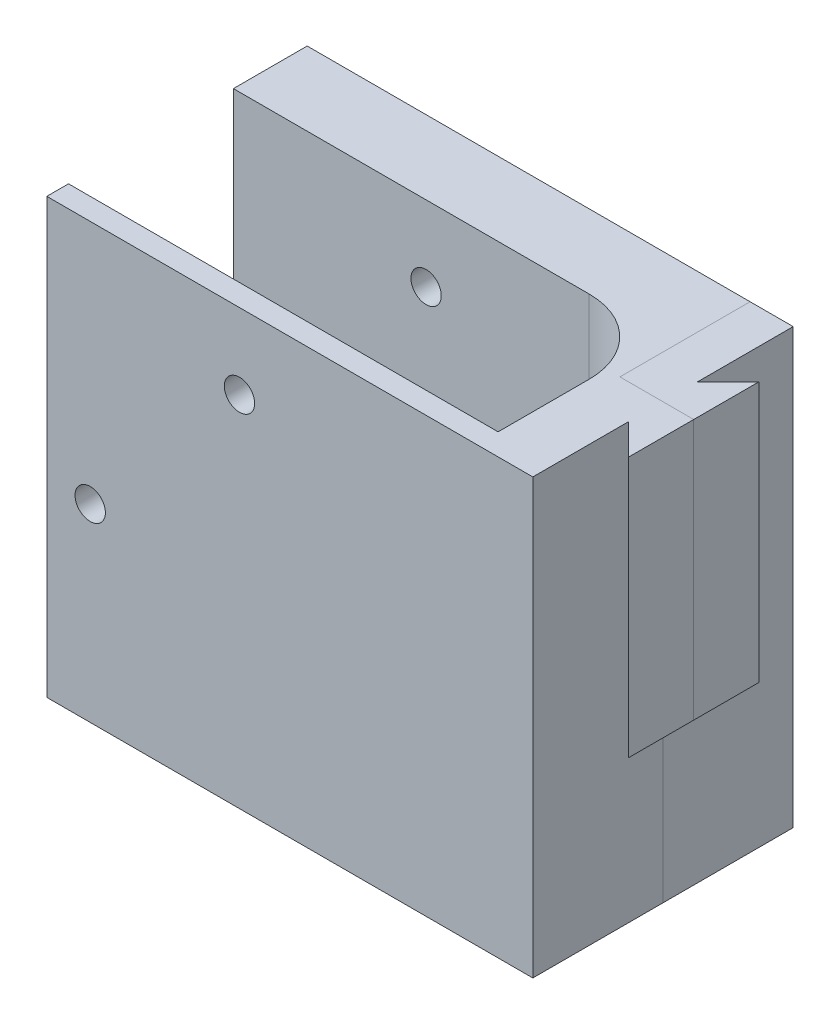
ISO-10303-21;
HEADER;
FILE_DESCRIPTION(('STEP AP214'),'2;1');
FILE_NAME('part.step','',(''),(''),'','','');
FILE_SCHEMA(('AUTOMOTIVE_DESIGN { 1 0 10303 214 1 1 1 1 }'));
ENDSEC;
DATA;
#1=APPLICATION_CONTEXT('core data for automotive mechanical design processes');
#2=APPLICATION_PROTOCOL_DEFINITION('international standard','automotive_design',2000,#1);
#3=PRODUCT_CONTEXT('',#1,'mechanical');
#4=PRODUCT('Part','Part','',(#3));
#5=PRODUCT_RELATED_PRODUCT_CATEGORY('part','',(#4));
#6=PRODUCT_DEFINITION_FORMATION('','',#4);
#7=PRODUCT_DEFINITION_CONTEXT('part definition',#1,'design');
#8=PRODUCT_DEFINITION('design','',#6,#7);
#9=PRODUCT_DEFINITION_SHAPE('','',#8);
#10=(LENGTH_UNIT() NAMED_UNIT(*) SI_UNIT(.MILLI.,.METRE.));
#11=(NAMED_UNIT(*) PLANE_ANGLE_UNIT() SI_UNIT($,.RADIAN.));
#12=(NAMED_UNIT(*) SI_UNIT($,.STERADIAN.) SOLID_ANGLE_UNIT());
#13=UNCERTAINTY_MEASURE_WITH_UNIT(LENGTH_MEASURE(1.E-05),#10,'distance_accuracy_value','');
#14=(GEOMETRIC_REPRESENTATION_CONTEXT(3) GLOBAL_UNCERTAINTY_ASSIGNED_CONTEXT((#13)) GLOBAL_UNIT_ASSIGNED_CONTEXT((#10,
#11,#12)) REPRESENTATION_CONTEXT('',''));
#15=CARTESIAN_POINT('',(0.,0.,0.));
#16=DIRECTION('',(0.,0.,1.));
#17=DIRECTION('',(1.,0.,0.));
#18=AXIS2_PLACEMENT_3D('',#15,#16,#17);
#19=CARTESIAN_POINT('',(71.0355339059328,-0.0100000000000031,15.));
#20=DIRECTION('',(0.,0.,1.));
#21=DIRECTION('',(1.,0.,0.));
#22=AXIS2_PLACEMENT_3D('',#19,#20,#21);
#23=PLANE('',#22);
#24=DIRECTION('',(0.,1.,0.));
#25=VECTOR('',#24,1.);
#26=CARTESIAN_POINT('',(51.0355339059328,-0.0100000000000031,15.));
#27=LINE('',#26,#25);
#28=CARTESIAN_POINT('',(51.0355339059328,0.,15.));
#29=VERTEX_POINT('',#28);
#30=CARTESIAN_POINT('',(51.0355339059328,50.,15.));
#31=VERTEX_POINT('',#30);
#32=EDGE_CURVE('E12',#29,#31,#27,.T.);
#33=ORIENTED_EDGE('',*,*,#32,.F.);
#34=DIRECTION('',(1.,0.,0.));
#35=VECTOR('',#34,1.);
#36=CARTESIAN_POINT('',(0.,0.,15.));
#37=LINE('',#36,#35);
#38=CARTESIAN_POINT('',(56.,0.,15.));
#39=VERTEX_POINT('',#38);
#40=EDGE_CURVE('E130',#29,#39,#37,.T.);
#41=ORIENTED_EDGE('',*,*,#40,.T.);
#42=DIRECTION('',(0.,1.,0.));
#43=VECTOR('',#42,1.);
#44=CARTESIAN_POINT('',(56.,0.,15.));
#45=LINE('',#44,#43);
#46=CARTESIAN_POINT('',(56.,20.,15.));
#47=VERTEX_POINT('',#46);
#48=EDGE_CURVE('E137',#39,#47,#45,.T.);
#49=ORIENTED_EDGE('',*,*,#48,.T.);
#50=DIRECTION('',(-1.,0.,0.));
#51=VECTOR('',#50,1.);
#52=CARTESIAN_POINT('',(0.,20.,15.));
#53=LINE('',#52,#51);
#54=CARTESIAN_POINT('',(59.5355339059328,20.,15.));
#55=VERTEX_POINT('',#54);
#56=EDGE_CURVE('E165',#55,#47,#53,.T.);
#57=ORIENTED_EDGE('',*,*,#56,.F.);
#58=DIRECTION('',(0.,-1.,0.));
#59=VECTOR('',#58,1.);
#60=CARTESIAN_POINT('',(59.5355339059328,20.,15.));
#61=LINE('',#60,#59);
#62=CARTESIAN_POINT('',(59.5355339059328,50.,15.));
#63=VERTEX_POINT('',#62);
#64=EDGE_CURVE('E146',#63,#55,#61,.T.);
#65=ORIENTED_EDGE('',*,*,#64,.F.);
#66=DIRECTION('',(1.,0.,0.));
#67=VECTOR('',#66,1.);
#68=CARTESIAN_POINT('',(0.,50.,15.));
#69=LINE('',#68,#67);
#70=EDGE_CURVE('E167',#31,#63,#69,.T.);
#71=ORIENTED_EDGE('',*,*,#70,.F.);
#72=EDGE_LOOP('',(#33,#41,#49,#57,#65,#71));
#73=FACE_BOUND('',#72,.T.);
#74=ADVANCED_FACE('F49',(#73),#23,.T.);
#75=CARTESIAN_POINT('',(51.0355339059328,-0.0100000000000031,15.));
#76=DIRECTION('',(-1.,0.,0.));
#77=DIRECTION('',(0.,0.,1.));
#78=AXIS2_PLACEMENT_3D('',#75,#76,#77);
#79=PLANE('',#78);
#80=DIRECTION('',(0.,-1.,0.));
#81=VECTOR('',#80,1.);
#82=CARTESIAN_POINT('',(51.0355339059328,0.,0.));
#83=LINE('',#82,#81);
#84=CARTESIAN_POINT('',(51.0355339059328,50.,0.));
#85=VERTEX_POINT('',#84);
#86=CARTESIAN_POINT('',(51.0355339059328,0.,0.));
#87=VERTEX_POINT('',#86);
#88=EDGE_CURVE('E120',#85,#87,#83,.T.);
#89=ORIENTED_EDGE('',*,*,#88,.T.);
#90=DIRECTION('',(0.,0.,1.));
#91=VECTOR('',#90,1.);
#92=CARTESIAN_POINT('',(51.0355339059328,0.,30.));
#93=LINE('',#92,#91);
#94=EDGE_CURVE('E127',#87,#29,#93,.T.);
#95=ORIENTED_EDGE('',*,*,#94,.T.);
#96=ORIENTED_EDGE('',*,*,#32,.T.);
#97=DIRECTION('',(0.,0.,1.));
#98=VECTOR('',#97,1.);
#99=CARTESIAN_POINT('',(51.0355339059328,50.,30.));
#100=LINE('',#99,#98);
#101=EDGE_CURVE('E132',#85,#31,#100,.T.);
#102=ORIENTED_EDGE('',*,*,#101,.F.);
#103=EDGE_LOOP('',(#89,#95,#96,#102));
#104=FACE_BOUND('',#103,.T.);
#105=ADVANCED_FACE('F135',(#104),#79,.T.);
#106=CARTESIAN_POINT('',(0.,0.,30.));
#107=DIRECTION('',(0.,1.,0.));
#108=DIRECTION('',(0.,0.,1.));
#109=AXIS2_PLACEMENT_3D('',#106,#107,#108);
#110=PLANE('',#109);
#111=ORIENTED_EDGE('',*,*,#94,.F.);
#112=DIRECTION('',(1.,0.,0.));
#113=VECTOR('',#112,1.);
#114=CARTESIAN_POINT('',(0.,0.,0.));
#115=LINE('',#114,#113);
#116=CARTESIAN_POINT('',(56.,0.,0.));
#117=VERTEX_POINT('',#116);
#118=EDGE_CURVE('E116',#87,#117,#115,.T.);
#119=ORIENTED_EDGE('',*,*,#118,.T.);
#120=DIRECTION('',(0.,0.,-1.));
#121=VECTOR('',#120,1.);
#122=CARTESIAN_POINT('',(56.,0.,30.));
#123=LINE('',#122,#121);
#124=EDGE_CURVE('E85',#39,#117,#123,.T.);
#125=ORIENTED_EDGE('',*,*,#124,.F.);
#126=ORIENTED_EDGE('',*,*,#40,.F.);
#127=EDGE_LOOP('',(#111,#119,#125,#126));
#128=FACE_BOUND('',#127,.T.);
#129=ADVANCED_FACE('F128',(#128),#110,.F.);
#130=CARTESIAN_POINT('',(56.,0.,30.));
#131=DIRECTION('',(-1.,0.,0.));
#132=DIRECTION('',(0.,-1.,0.));
#133=AXIS2_PLACEMENT_3D('',#130,#131,#132);
#134=PLANE('',#133);
#135=ORIENTED_EDGE('',*,*,#48,.F.);
#136=ORIENTED_EDGE('',*,*,#124,.T.);
#137=DIRECTION('',(0.,1.,0.));
#138=VECTOR('',#137,1.);
#139=CARTESIAN_POINT('',(56.,0.,0.));
#140=LINE('',#139,#138);
#141=CARTESIAN_POINT('',(56.,50.,0.));
#142=VERTEX_POINT('',#141);
#143=EDGE_CURVE('E121',#117,#142,#140,.T.);
#144=ORIENTED_EDGE('',*,*,#143,.T.);
#145=DIRECTION('',(0.,0.,-1.));
#146=VECTOR('',#145,1.);
#147=CARTESIAN_POINT('',(56.,50.,30.));
#148=LINE('',#147,#146);
#149=CARTESIAN_POINT('',(56.,50.,11.0355339059327));
#150=VERTEX_POINT('',#149);
#151=EDGE_CURVE('E148',#150,#142,#148,.T.);
#152=ORIENTED_EDGE('',*,*,#151,.F.);
#153=DIRECTION('',(0.,1.,0.));
#154=VECTOR('',#153,1.);
#155=CARTESIAN_POINT('',(56.0000000000001,20.,11.0355339059327));
#156=LINE('',#155,#154);
#157=CARTESIAN_POINT('',(56.0000000000001,20.,11.0355339059327));
#158=VERTEX_POINT('',#157);
#159=EDGE_CURVE('E151',#158,#150,#156,.T.);
#160=ORIENTED_EDGE('',*,*,#159,.F.);
#161=DIRECTION('',(0.,0.,1.));
#162=VECTOR('',#161,1.);
#163=CARTESIAN_POINT('',(56.,20.,30.));
#164=LINE('',#163,#162);
#165=EDGE_CURVE('E143',#158,#47,#164,.T.);
#166=ORIENTED_EDGE('',*,*,#165,.T.);
#167=EDGE_LOOP('',(#135,#136,#144,#152,#160,#166));
#168=FACE_BOUND('',#167,.T.);
#169=ADVANCED_FACE('F172',(#168),#134,.F.);
#170=CARTESIAN_POINT('',(59.5355339059328,20.,7.5));
#171=DIRECTION('',(-0.707106781186547,0.,-0.707106781186548));
#172=DIRECTION('',(-0.707106781186548,0.,0.707106781186547));
#173=AXIS2_PLACEMENT_3D('',#170,#171,#172);
#174=PLANE('',#173);
#175=DIRECTION('',(-0.707106781186548,0.,0.707106781186547));
#176=VECTOR('',#175,1.);
#177=CARTESIAN_POINT('',(59.5355339059328,50.,7.5));
#178=LINE('',#177,#176);
#179=CARTESIAN_POINT('',(59.5355339059328,50.,7.5));
#180=VERTEX_POINT('',#179);
#181=EDGE_CURVE('E59',#180,#150,#178,.T.);
#182=ORIENTED_EDGE('',*,*,#181,.F.);
#183=DIRECTION('',(0.,1.,0.));
#184=VECTOR('',#183,1.);
#185=CARTESIAN_POINT('',(59.5355339059328,20.,7.5));
#186=LINE('',#185,#184);
#187=CARTESIAN_POINT('',(59.5355339059328,20.,7.5));
#188=VERTEX_POINT('',#187);
#189=EDGE_CURVE('E123',#188,#180,#186,.T.);
#190=ORIENTED_EDGE('',*,*,#189,.F.);
#191=DIRECTION('',(-0.707106781186548,0.,0.707106781186547));
#192=VECTOR('',#191,1.);
#193=CARTESIAN_POINT('',(59.5355339059328,20.,7.5));
#194=LINE('',#193,#192);
#195=EDGE_CURVE('E150',#188,#158,#194,.T.);
#196=ORIENTED_EDGE('',*,*,#195,.T.);
#197=ORIENTED_EDGE('',*,*,#159,.T.);
#198=EDGE_LOOP('',(#182,#190,#196,#197));
#199=FACE_BOUND('',#198,.T.);
#200=ADVANCED_FACE('F176',(#199),#174,.T.);
#201=CARTESIAN_POINT('',(0.,20.,0.));
#202=DIRECTION('',(0.,-1.,0.));
#203=DIRECTION('',(0.,0.,-1.));
#204=AXIS2_PLACEMENT_3D('',#201,#202,#203);
#205=PLANE('',#204);
#206=DIRECTION('',(0.,0.,-1.));
#207=VECTOR('',#206,1.);
#208=CARTESIAN_POINT('',(59.5355339059328,20.,7.5));
#209=LINE('',#208,#207);
#210=EDGE_CURVE('E77',#55,#188,#209,.T.);
#211=ORIENTED_EDGE('',*,*,#210,.F.);
#212=ORIENTED_EDGE('',*,*,#56,.T.);
#213=ORIENTED_EDGE('',*,*,#165,.F.);
#214=ORIENTED_EDGE('',*,*,#195,.F.);
#215=EDGE_LOOP('',(#211,#212,#213,#214));
#216=FACE_BOUND('',#215,.T.);
#217=ADVANCED_FACE('F175',(#216),#205,.T.);
#218=CARTESIAN_POINT('',(0.,50.,30.));
#219=DIRECTION('',(0.,1.,0.));
#220=DIRECTION('',(0.,0.,1.));
#221=AXIS2_PLACEMENT_3D('',#218,#219,#220);
#222=PLANE('',#221);
#223=DIRECTION('',(1.,0.,0.));
#224=VECTOR('',#223,1.);
#225=CARTESIAN_POINT('',(0.,50.,0.));
#226=LINE('',#225,#224);
#227=EDGE_CURVE('E93',#85,#142,#226,.T.);
#228=ORIENTED_EDGE('',*,*,#227,.F.);
#229=ORIENTED_EDGE('',*,*,#101,.T.);
#230=ORIENTED_EDGE('',*,*,#70,.T.);
#231=DIRECTION('',(0.,0.,-1.));
#232=VECTOR('',#231,1.);
#233=CARTESIAN_POINT('',(59.5355339059328,50.,7.5));
#234=LINE('',#233,#232);
#235=EDGE_CURVE('E53',#63,#180,#234,.T.);
#236=ORIENTED_EDGE('',*,*,#235,.T.);
#237=ORIENTED_EDGE('',*,*,#181,.T.);
#238=ORIENTED_EDGE('',*,*,#151,.T.);
#239=EDGE_LOOP('',(#228,#229,#230,#236,#237,#238));
#240=FACE_BOUND('',#239,.T.);
#241=ADVANCED_FACE('F177',(#240),#222,.T.);
#242=CARTESIAN_POINT('',(59.5355339059328,20.,7.5));
#243=DIRECTION('',(1.,0.,0.));
#244=DIRECTION('',(0.,0.,-1.));
#245=AXIS2_PLACEMENT_3D('',#242,#243,#244);
#246=PLANE('',#245);
#247=ORIENTED_EDGE('',*,*,#235,.F.);
#248=ORIENTED_EDGE('',*,*,#64,.T.);
#249=ORIENTED_EDGE('',*,*,#210,.T.);
#250=ORIENTED_EDGE('',*,*,#189,.T.);
#251=EDGE_LOOP('',(#247,#248,#249,#250));
#252=FACE_BOUND('',#251,.T.);
#253=ADVANCED_FACE('F51',(#252),#246,.T.);
#254=CARTESIAN_POINT('',(0.,0.,0.));
#255=DIRECTION('',(0.,0.,1.));
#256=DIRECTION('',(1.,0.,0.));
#257=AXIS2_PLACEMENT_3D('',#254,#255,#256);
#258=PLANE('',#257);
#259=ORIENTED_EDGE('',*,*,#88,.F.);
#260=ORIENTED_EDGE('',*,*,#227,.T.);
#261=ORIENTED_EDGE('',*,*,#143,.F.);
#262=ORIENTED_EDGE('',*,*,#118,.F.);
#263=EDGE_LOOP('',(#259,#260,#261,#262));
#264=FACE_BOUND('',#263,.T.);
#265=ADVANCED_FACE('F118',(#264),#258,.F.);
#266=CLOSED_SHELL('',(#74,#105,#129,#169,#200,#217,#241,#253,#265));
#267=MANIFOLD_SOLID_BREP('B2',#266);
#268=CARTESIAN_POINT('',(71.0355339059328,-0.0100000000000031,15.));
#269=DIRECTION('',(0.,0.,1.));
#270=DIRECTION('',(1.,0.,0.));
#271=AXIS2_PLACEMENT_3D('',#268,#269,#270);
#272=PLANE('',#271);
#273=DIRECTION('',(0.,1.,0.));
#274=VECTOR('',#273,1.);
#275=CARTESIAN_POINT('',(51.0355339059328,-0.0100000000000031,15.));
#276=LINE('',#275,#274);
#277=CARTESIAN_POINT('',(51.0355339059328,0.,15.));
#278=VERTEX_POINT('',#277);
#279=CARTESIAN_POINT('',(51.0355339059328,50.,15.));
#280=VERTEX_POINT('',#279);
#281=EDGE_CURVE('E47',#278,#280,#276,.T.);
#282=ORIENTED_EDGE('',*,*,#281,.T.);
#283=DIRECTION('',(1.,0.,0.));
#284=VECTOR('',#283,1.);
#285=CARTESIAN_POINT('',(0.,50.,15.));
#286=LINE('',#285,#284);
#287=CARTESIAN_POINT('',(59.5355339059328,50.,15.));
#288=VERTEX_POINT('',#287);
#289=EDGE_CURVE('E523',#280,#288,#286,.T.);
#290=ORIENTED_EDGE('',*,*,#289,.T.);
#291=DIRECTION('',(0.,-1.,0.));
#292=VECTOR('',#291,1.);
#293=CARTESIAN_POINT('',(59.5355339059328,20.,15.));
#294=LINE('',#293,#292);
#295=CARTESIAN_POINT('',(59.5355339059328,20.,15.));
#296=VERTEX_POINT('',#295);
#297=EDGE_CURVE('E264',#288,#296,#294,.T.);
#298=ORIENTED_EDGE('',*,*,#297,.T.);
#299=DIRECTION('',(-1.,0.,0.));
#300=VECTOR('',#299,1.);
#301=CARTESIAN_POINT('',(0.,20.,15.));
#302=LINE('',#301,#300);
#303=CARTESIAN_POINT('',(56.,20.,15.));
#304=VERTEX_POINT('',#303);
#305=EDGE_CURVE('E279',#296,#304,#302,.T.);
#306=ORIENTED_EDGE('',*,*,#305,.T.);
#307=DIRECTION('',(0.,1.,0.));
#308=VECTOR('',#307,1.);
#309=CARTESIAN_POINT('',(56.,0.,15.));
#310=LINE('',#309,#308);
#311=CARTESIAN_POINT('',(56.,0.,15.));
#312=VERTEX_POINT('',#311);
#313=EDGE_CURVE('E367',#312,#304,#310,.T.);
#314=ORIENTED_EDGE('',*,*,#313,.F.);
#315=DIRECTION('',(1.,0.,0.));
#316=VECTOR('',#315,1.);
#317=CARTESIAN_POINT('',(0.,0.,15.));
#318=LINE('',#317,#316);
#319=EDGE_CURVE('E533',#278,#312,#318,.T.);
#320=ORIENTED_EDGE('',*,*,#319,.F.);
#321=EDGE_LOOP('',(#282,#290,#298,#306,#314,#320));
#322=FACE_BOUND('',#321,.T.);
#323=ADVANCED_FACE('F254',(#322),#272,.F.);
#324=CARTESIAN_POINT('',(51.0355339059328,-0.0100000000000031,15.));
#325=DIRECTION('',(-1.,0.,0.));
#326=DIRECTION('',(0.,0.,1.));
#327=AXIS2_PLACEMENT_3D('',#324,#325,#326);
#328=PLANE('',#327);
#329=DIRECTION('',(0.,-1.,0.));
#330=VECTOR('',#329,1.);
#331=CARTESIAN_POINT('',(51.0355339059328,0.,0.));
#332=LINE('',#331,#330);
#333=CARTESIAN_POINT('',(51.0355339059328,50.,0.));
#334=VERTEX_POINT('',#333);
#335=CARTESIAN_POINT('',(51.0355339059328,0.,0.));
#336=VERTEX_POINT('',#335);
#337=EDGE_CURVE('E370',#334,#336,#332,.T.);
#338=ORIENTED_EDGE('',*,*,#337,.F.);
#339=DIRECTION('',(0.,0.,1.));
#340=VECTOR('',#339,1.);
#341=CARTESIAN_POINT('',(51.0355339059328,50.,30.));
#342=LINE('',#341,#340);
#343=EDGE_CURVE('E526',#334,#280,#342,.T.);
#344=ORIENTED_EDGE('',*,*,#343,.T.);
#345=ORIENTED_EDGE('',*,*,#281,.F.);
#346=DIRECTION('',(0.,0.,1.));
#347=VECTOR('',#346,1.);
#348=CARTESIAN_POINT('',(51.0355339059328,0.,30.));
#349=LINE('',#348,#347);
#350=EDGE_CURVE('E258',#336,#278,#349,.T.);
#351=ORIENTED_EDGE('',*,*,#350,.F.);
#352=EDGE_LOOP('',(#338,#344,#345,#351));
#353=FACE_BOUND('',#352,.T.);
#354=ADVANCED_FACE('F256',(#353),#328,.F.);
#355=CARTESIAN_POINT('',(0.,0.,30.));
#356=DIRECTION('',(-1.,0.,0.));
#357=DIRECTION('',(0.,0.,1.));
#358=AXIS2_PLACEMENT_3D('',#355,#356,#357);
#359=PLANE('',#358);
#360=DIRECTION('',(0.,1.,0.));
#361=VECTOR('',#360,1.);
#362=CARTESIAN_POINT('',(0.,0.,27.5));
#363=LINE('',#362,#361);
#364=CARTESIAN_POINT('',(0.,0.,27.5));
#365=VERTEX_POINT('',#364);
#366=CARTESIAN_POINT('',(0.,50.,27.5));
#367=VERTEX_POINT('',#366);
#368=EDGE_CURVE('E429',#365,#367,#363,.T.);
#369=ORIENTED_EDGE('',*,*,#368,.F.);
#370=DIRECTION('',(0.,0.,-1.));
#371=VECTOR('',#370,1.);
#372=CARTESIAN_POINT('',(0.,0.,30.));
#373=LINE('',#372,#371);
#374=CARTESIAN_POINT('',(0.,0.,30.));
#375=VERTEX_POINT('',#374);
#376=EDGE_CURVE('E498',#375,#365,#373,.T.);
#377=ORIENTED_EDGE('',*,*,#376,.F.);
#378=DIRECTION('',(0.,1.,0.));
#379=VECTOR('',#378,1.);
#380=CARTESIAN_POINT('',(0.,0.,30.));
#381=LINE('',#380,#379);
#382=CARTESIAN_POINT('',(0.,50.,30.));
#383=VERTEX_POINT('',#382);
#384=EDGE_CURVE('E483',#375,#383,#381,.T.);
#385=ORIENTED_EDGE('',*,*,#384,.T.);
#386=DIRECTION('',(0.,0.,-1.));
#387=VECTOR('',#386,1.);
#388=CARTESIAN_POINT('',(0.,50.,30.));
#389=LINE('',#388,#387);
#390=EDGE_CURVE('E503',#383,#367,#389,.T.);
#391=ORIENTED_EDGE('',*,*,#390,.T.);
#392=EDGE_LOOP('',(#369,#377,#385,#391));
#393=FACE_BOUND('',#392,.T.);
#394=ADVANCED_FACE('F552',(#393),#359,.T.);
#395=CARTESIAN_POINT('',(22.2,41.3,30.));
#396=DIRECTION('',(0.,0.,-1.));
#397=DIRECTION('',(-1.,0.,0.));
#398=AXIS2_PLACEMENT_3D('',#395,#396,#397);
#399=CYLINDRICAL_SURFACE('',#398,1.75);
#400=CARTESIAN_POINT('',(22.2,41.3,27.5));
#401=DIRECTION('',(0.,0.,1.));
#402=DIRECTION('',(1.,0.,0.));
#403=AXIS2_PLACEMENT_3D('',#400,#401,#402);
#404=CIRCLE('',#403,1.75);
#405=CARTESIAN_POINT('',(23.95,41.3,27.5));
#406=VERTEX_POINT('',#405);
#407=EDGE_CURVE('E450',#406,#406,#404,.F.);
#408=ORIENTED_EDGE('',*,*,#407,.T.);
#409=EDGE_LOOP('',(#408));
#410=FACE_BOUND('',#409,.T.);
#411=CARTESIAN_POINT('',(22.2,41.3,30.));
#412=DIRECTION('',(0.,0.,-1.));
#413=DIRECTION('',(-1.,0.,0.));
#414=AXIS2_PLACEMENT_3D('',#411,#412,#413);
#415=CIRCLE('',#414,1.75);
#416=CARTESIAN_POINT('',(20.45,41.3,30.));
#417=VERTEX_POINT('',#416);
#418=EDGE_CURVE('E464',#417,#417,#415,.T.);
#419=ORIENTED_EDGE('',*,*,#418,.F.);
#420=EDGE_LOOP('',(#419));
#421=FACE_BOUND('',#420,.T.);
#422=ADVANCED_FACE('F593',(#410,#421),#399,.F.);
#423=CARTESIAN_POINT('',(5.,21.8,30.));
#424=DIRECTION('',(0.,0.,-1.));
#425=DIRECTION('',(-1.,0.,0.));
#426=AXIS2_PLACEMENT_3D('',#423,#424,#425);
#427=CYLINDRICAL_SURFACE('',#426,1.75);
#428=CARTESIAN_POINT('',(5.,21.8,27.5));
#429=DIRECTION('',(0.,0.,1.));
#430=DIRECTION('',(1.,0.,0.));
#431=AXIS2_PLACEMENT_3D('',#428,#429,#430);
#432=CIRCLE('',#431,1.75);
#433=CARTESIAN_POINT('',(6.75,21.8,27.5));
#434=VERTEX_POINT('',#433);
#435=EDGE_CURVE('E449',#434,#434,#432,.F.);
#436=ORIENTED_EDGE('',*,*,#435,.T.);
#437=EDGE_LOOP('',(#436));
#438=FACE_BOUND('',#437,.T.);
#439=CARTESIAN_POINT('',(5.,21.8,30.));
#440=DIRECTION('',(0.,0.,-1.));
#441=DIRECTION('',(-1.,0.,0.));
#442=AXIS2_PLACEMENT_3D('',#439,#440,#441);
#443=CIRCLE('',#442,1.75);
#444=CARTESIAN_POINT('',(3.25,21.8,30.));
#445=VERTEX_POINT('',#444);
#446=EDGE_CURVE('E455',#445,#445,#443,.T.);
#447=ORIENTED_EDGE('',*,*,#446,.F.);
#448=EDGE_LOOP('',(#447));
#449=FACE_BOUND('',#448,.T.);
#450=ADVANCED_FACE('F606',(#438,#449),#427,.F.);
#451=CARTESIAN_POINT('',(0.,0.,30.));
#452=DIRECTION('',(0.,1.,0.));
#453=DIRECTION('',(0.,0.,1.));
#454=AXIS2_PLACEMENT_3D('',#451,#452,#453);
#455=PLANE('',#454);
#456=DIRECTION('',(1.,0.,0.));
#457=VECTOR('',#456,1.);
#458=CARTESIAN_POINT('',(0.,0.,0.));
#459=LINE('',#458,#457);
#460=CARTESIAN_POINT('',(0.,0.,0.));
#461=VERTEX_POINT('',#460);
#462=EDGE_CURVE('E459',#461,#336,#459,.T.);
#463=ORIENTED_EDGE('',*,*,#462,.T.);
#464=ORIENTED_EDGE('',*,*,#350,.T.);
#465=ORIENTED_EDGE('',*,*,#319,.T.);
#466=DIRECTION('',(0.,0.,-1.));
#467=VECTOR('',#466,1.);
#468=CARTESIAN_POINT('',(56.,0.,30.));
#469=LINE('',#468,#467);
#470=CARTESIAN_POINT('',(56.,0.,30.));
#471=VERTEX_POINT('',#470);
#472=EDGE_CURVE('E371',#471,#312,#469,.T.);
#473=ORIENTED_EDGE('',*,*,#472,.F.);
#474=DIRECTION('',(1.,0.,0.));
#475=VECTOR('',#474,1.);
#476=CARTESIAN_POINT('',(0.,0.,30.));
#477=LINE('',#476,#475);
#478=EDGE_CURVE('E471',#375,#471,#477,.T.);
#479=ORIENTED_EDGE('',*,*,#478,.F.);
#480=ORIENTED_EDGE('',*,*,#376,.T.);
#481=DIRECTION('',(1.,0.,0.));
#482=VECTOR('',#481,1.);
#483=CARTESIAN_POINT('',(49.5,0.,27.5));
#484=LINE('',#483,#482);
#485=CARTESIAN_POINT('',(49.5,0.,27.5));
#486=VERTEX_POINT('',#485);
#487=EDGE_CURVE('E398',#365,#486,#484,.T.);
#488=ORIENTED_EDGE('',*,*,#487,.T.);
#489=DIRECTION('',(0.,0.,-1.));
#490=VECTOR('',#489,1.);
#491=CARTESIAN_POINT('',(49.5,0.,17.));
#492=LINE('',#491,#490);
#493=CARTESIAN_POINT('',(49.5,0.,17.));
#494=VERTEX_POINT('',#493);
#495=EDGE_CURVE('E402',#486,#494,#492,.T.);
#496=ORIENTED_EDGE('',*,*,#495,.T.);
#497=CARTESIAN_POINT('',(41.,0.,17.));
#498=DIRECTION('',(0.,1.,0.));
#499=DIRECTION('',(0.,0.,1.));
#500=AXIS2_PLACEMENT_3D('',#497,#498,#499);
#501=CIRCLE('',#500,8.50000000000001);
#502=CARTESIAN_POINT('',(41.,0.,8.49999999999999));
#503=VERTEX_POINT('',#502);
#504=EDGE_CURVE('E407',#494,#503,#501,.T.);
#505=ORIENTED_EDGE('',*,*,#504,.T.);
#506=DIRECTION('',(-1.,0.,0.));
#507=VECTOR('',#506,1.);
#508=CARTESIAN_POINT('',(0.,0.,8.49999999999999));
#509=LINE('',#508,#507);
#510=CARTESIAN_POINT('',(0.,0.,8.49999999999999));
#511=VERTEX_POINT('',#510);
#512=EDGE_CURVE('E411',#503,#511,#509,.T.);
#513=ORIENTED_EDGE('',*,*,#512,.T.);
#514=EDGE_CURVE('E487',#511,#461,#373,.T.);
#515=ORIENTED_EDGE('',*,*,#514,.T.);
#516=EDGE_LOOP('',(#463,#464,#465,#473,#479,#480,#488,#496,#505,#513,#515));
#517=FACE_BOUND('',#516,.T.);
#518=ADVANCED_FACE('F540',(#517),#455,.F.);
#519=CARTESIAN_POINT('',(56.,0.,30.));
#520=DIRECTION('',(-1.,0.,0.));
#521=DIRECTION('',(0.,-1.,0.));
#522=AXIS2_PLACEMENT_3D('',#519,#520,#521);
#523=PLANE('',#522);
#524=ORIENTED_EDGE('',*,*,#472,.T.);
#525=ORIENTED_EDGE('',*,*,#313,.T.);
#526=DIRECTION('',(0.,0.,1.));
#527=VECTOR('',#526,1.);
#528=CARTESIAN_POINT('',(56.,20.,30.));
#529=LINE('',#528,#527);
#530=CARTESIAN_POINT('',(56.,20.,18.9644660940673));
#531=VERTEX_POINT('',#530);
#532=EDGE_CURVE('E359',#304,#531,#529,.T.);
#533=ORIENTED_EDGE('',*,*,#532,.T.);
#534=DIRECTION('',(0.,1.,0.));
#535=VECTOR('',#534,1.);
#536=CARTESIAN_POINT('',(56.,20.,18.9644660940673));
#537=LINE('',#536,#535);
#538=CARTESIAN_POINT('',(56.,50.,18.9644660940673));
#539=VERTEX_POINT('',#538);
#540=EDGE_CURVE('E364',#531,#539,#537,.T.);
#541=ORIENTED_EDGE('',*,*,#540,.T.);
#542=DIRECTION('',(0.,0.,-1.));
#543=VECTOR('',#542,1.);
#544=CARTESIAN_POINT('',(56.,50.,30.));
#545=LINE('',#544,#543);
#546=CARTESIAN_POINT('',(56.,50.,30.));
#547=VERTEX_POINT('',#546);
#548=EDGE_CURVE('E507',#547,#539,#545,.T.);
#549=ORIENTED_EDGE('',*,*,#548,.F.);
#550=DIRECTION('',(0.,1.,0.));
#551=VECTOR('',#550,1.);
#552=CARTESIAN_POINT('',(56.,0.,30.));
#553=LINE('',#552,#551);
#554=EDGE_CURVE('E475',#471,#547,#553,.T.);
#555=ORIENTED_EDGE('',*,*,#554,.F.);
#556=EDGE_LOOP('',(#524,#525,#533,#541,#549,#555));
#557=FACE_BOUND('',#556,.T.);
#558=ADVANCED_FACE('F362',(#557),#523,.F.);
#559=CARTESIAN_POINT('',(0.,50.,30.));
#560=DIRECTION('',(0.,1.,0.));
#561=DIRECTION('',(0.,0.,1.));
#562=AXIS2_PLACEMENT_3D('',#559,#560,#561);
#563=PLANE('',#562);
#564=ORIENTED_EDGE('',*,*,#343,.F.);
#565=DIRECTION('',(1.,0.,0.));
#566=VECTOR('',#565,1.);
#567=CARTESIAN_POINT('',(0.,50.,0.));
#568=LINE('',#567,#566);
#569=CARTESIAN_POINT('',(0.,50.,0.));
#570=VERTEX_POINT('',#569);
#571=EDGE_CURVE('E491',#570,#334,#568,.T.);
#572=ORIENTED_EDGE('',*,*,#571,.F.);
#573=CARTESIAN_POINT('',(0.,50.,8.49999999999999));
#574=VERTEX_POINT('',#573);
#575=EDGE_CURVE('E502',#574,#570,#389,.T.);
#576=ORIENTED_EDGE('',*,*,#575,.F.);
#577=DIRECTION('',(-1.,0.,0.));
#578=VECTOR('',#577,1.);
#579=CARTESIAN_POINT('',(0.,50.,8.49999999999999));
#580=LINE('',#579,#578);
#581=CARTESIAN_POINT('',(41.,50.,8.49999999999999));
#582=VERTEX_POINT('',#581);
#583=EDGE_CURVE('E403',#582,#574,#580,.T.);
#584=ORIENTED_EDGE('',*,*,#583,.F.);
#585=CARTESIAN_POINT('',(41.,50.,17.));
#586=DIRECTION('',(0.,1.,0.));
#587=DIRECTION('',(0.,0.,1.));
#588=AXIS2_PLACEMENT_3D('',#585,#586,#587);
#589=CIRCLE('',#588,8.50000000000001);
#590=CARTESIAN_POINT('',(49.5,50.,17.));
#591=VERTEX_POINT('',#590);
#592=EDGE_CURVE('E423',#591,#582,#589,.T.);
#593=ORIENTED_EDGE('',*,*,#592,.F.);
#594=DIRECTION('',(0.,0.,-1.));
#595=VECTOR('',#594,1.);
#596=CARTESIAN_POINT('',(49.5,50.,17.));
#597=LINE('',#596,#595);
#598=CARTESIAN_POINT('',(49.5,50.,27.5));
#599=VERTEX_POINT('',#598);
#600=EDGE_CURVE('E419',#599,#591,#597,.T.);
#601=ORIENTED_EDGE('',*,*,#600,.F.);
#602=DIRECTION('',(1.,0.,0.));
#603=VECTOR('',#602,1.);
#604=CARTESIAN_POINT('',(49.5,50.,27.5));
#605=LINE('',#604,#603);
#606=EDGE_CURVE('E396',#367,#599,#605,.T.);
#607=ORIENTED_EDGE('',*,*,#606,.F.);
#608=ORIENTED_EDGE('',*,*,#390,.F.);
#609=DIRECTION('',(1.,0.,0.));
#610=VECTOR('',#609,1.);
#611=CARTESIAN_POINT('',(0.,50.,30.));
#612=LINE('',#611,#610);
#613=EDGE_CURVE('E479',#383,#547,#612,.T.);
#614=ORIENTED_EDGE('',*,*,#613,.T.);
#615=ORIENTED_EDGE('',*,*,#548,.T.);
#616=DIRECTION('',(0.707106781186565,0.,0.707106781186531));
#617=VECTOR('',#616,1.);
#618=CARTESIAN_POINT('',(59.5355339059328,50.,22.5));
#619=LINE('',#618,#617);
#620=CARTESIAN_POINT('',(59.5355339059328,50.,22.5));
#621=VERTEX_POINT('',#620);
#622=EDGE_CURVE('E378',#539,#621,#619,.T.);
#623=ORIENTED_EDGE('',*,*,#622,.T.);
#624=DIRECTION('',(0.,0.,-1.));
#625=VECTOR('',#624,1.);
#626=CARTESIAN_POINT('',(59.5355339059328,50.,7.5));
#627=LINE('',#626,#625);
#628=EDGE_CURVE('E385',#621,#288,#627,.T.);
#629=ORIENTED_EDGE('',*,*,#628,.T.);
#630=ORIENTED_EDGE('',*,*,#289,.F.);
#631=EDGE_LOOP('',(#564,#572,#576,#584,#593,#601,#607,#608,#614,#615,#623,#629,#630));
#632=FACE_BOUND('',#631,.T.);
#633=ADVANCED_FACE('F559',(#632),#563,.T.);
#634=DIRECTION('',(0.,1.,0.));
#635=VECTOR('',#634,1.);
#636=CARTESIAN_POINT('',(0.,0.,8.49999999999999));
#637=LINE('',#636,#635);
#638=EDGE_CURVE('E433',#511,#574,#637,.T.);
#639=ORIENTED_EDGE('',*,*,#638,.T.);
#640=ORIENTED_EDGE('',*,*,#575,.T.);
#641=DIRECTION('',(0.,1.,0.));
#642=VECTOR('',#641,1.);
#643=CARTESIAN_POINT('',(0.,0.,0.));
#644=LINE('',#643,#642);
#645=EDGE_CURVE('E476',#461,#570,#644,.T.);
#646=ORIENTED_EDGE('',*,*,#645,.F.);
#647=ORIENTED_EDGE('',*,*,#514,.F.);
#648=EDGE_LOOP('',(#639,#640,#646,#647));
#649=FACE_BOUND('',#648,.T.);
#650=ADVANCED_FACE('F575',(#649),#359,.T.);
#651=CARTESIAN_POINT('',(0.,0.,30.));
#652=DIRECTION('',(0.,0.,1.));
#653=DIRECTION('',(1.,0.,0.));
#654=AXIS2_PLACEMENT_3D('',#651,#652,#653);
#655=PLANE('',#654);
#656=ORIENTED_EDGE('',*,*,#446,.T.);
#657=EDGE_LOOP('',(#656));
#658=FACE_BOUND('',#657,.T.);
#659=ORIENTED_EDGE('',*,*,#418,.T.);
#660=EDGE_LOOP('',(#659));
#661=FACE_BOUND('',#660,.T.);
#662=ORIENTED_EDGE('',*,*,#478,.T.);
#663=ORIENTED_EDGE('',*,*,#554,.T.);
#664=ORIENTED_EDGE('',*,*,#613,.F.);
#665=ORIENTED_EDGE('',*,*,#384,.F.);
#666=EDGE_LOOP('',(#662,#663,#664,#665));
#667=FACE_BOUND('',#666,.T.);
#668=ADVANCED_FACE('F549',(#658,#661,#667),#655,.T.);
#669=CARTESIAN_POINT('',(0.,0.,0.));
#670=DIRECTION('',(0.,0.,1.));
#671=DIRECTION('',(1.,0.,0.));
#672=AXIS2_PLACEMENT_3D('',#669,#670,#671);
#673=PLANE('',#672);
#674=CARTESIAN_POINT('',(5.,21.8,0.));
#675=DIRECTION('',(0.,0.,-1.));
#676=DIRECTION('',(-1.,0.,0.));
#677=AXIS2_PLACEMENT_3D('',#674,#675,#676);
#678=CIRCLE('',#677,1.75);
#679=CARTESIAN_POINT('',(3.25,21.8,0.));
#680=VERTEX_POINT('',#679);
#681=EDGE_CURVE('E460',#680,#680,#678,.T.);
#682=ORIENTED_EDGE('',*,*,#681,.F.);
#683=EDGE_LOOP('',(#682));
#684=FACE_BOUND('',#683,.T.);
#685=CARTESIAN_POINT('',(22.2,41.3,0.));
#686=DIRECTION('',(0.,0.,-1.));
#687=DIRECTION('',(-1.,0.,0.));
#688=AXIS2_PLACEMENT_3D('',#685,#686,#687);
#689=CIRCLE('',#688,1.75);
#690=CARTESIAN_POINT('',(20.45,41.3,0.));
#691=VERTEX_POINT('',#690);
#692=EDGE_CURVE('E454',#691,#691,#689,.T.);
#693=ORIENTED_EDGE('',*,*,#692,.F.);
#694=EDGE_LOOP('',(#693));
#695=FACE_BOUND('',#694,.T.);
#696=ORIENTED_EDGE('',*,*,#571,.T.);
#697=ORIENTED_EDGE('',*,*,#337,.T.);
#698=ORIENTED_EDGE('',*,*,#462,.F.);
#699=ORIENTED_EDGE('',*,*,#645,.T.);
#700=EDGE_LOOP('',(#696,#697,#698,#699));
#701=FACE_BOUND('',#700,.T.);
#702=ADVANCED_FACE('F581',(#684,#695,#701),#673,.F.);
#703=CARTESIAN_POINT('',(22.2,41.3,8.49999999999999));
#704=DIRECTION('',(0.,0.,-1.));
#705=DIRECTION('',(-1.,0.,0.));
#706=AXIS2_PLACEMENT_3D('',#703,#704,#705);
#707=CIRCLE('',#706,1.75);
#708=CARTESIAN_POINT('',(20.45,41.3,8.49999999999999));
#709=VERTEX_POINT('',#708);
#710=EDGE_CURVE('E445',#709,#709,#707,.F.);
#711=ORIENTED_EDGE('',*,*,#710,.T.);
#712=EDGE_LOOP('',(#711));
#713=FACE_BOUND('',#712,.T.);
#714=ORIENTED_EDGE('',*,*,#692,.T.);
#715=EDGE_LOOP('',(#714));
#716=FACE_BOUND('',#715,.T.);
#717=ADVANCED_FACE('F583',(#713,#716),#399,.F.);
#718=CARTESIAN_POINT('',(5.,21.8,8.49999999999999));
#719=DIRECTION('',(0.,0.,-1.));
#720=DIRECTION('',(-1.,0.,0.));
#721=AXIS2_PLACEMENT_3D('',#718,#719,#720);
#722=CIRCLE('',#721,1.75);
#723=CARTESIAN_POINT('',(3.25,21.8,8.49999999999999));
#724=VERTEX_POINT('',#723);
#725=EDGE_CURVE('E432',#724,#724,#722,.F.);
#726=ORIENTED_EDGE('',*,*,#725,.T.);
#727=EDGE_LOOP('',(#726));
#728=FACE_BOUND('',#727,.T.);
#729=ORIENTED_EDGE('',*,*,#681,.T.);
#730=EDGE_LOOP('',(#729));
#731=FACE_BOUND('',#730,.T.);
#732=ADVANCED_FACE('F590',(#728,#731),#427,.F.);
#733=CARTESIAN_POINT('',(49.5,0.,27.5));
#734=DIRECTION('',(0.,0.,1.));
#735=DIRECTION('',(1.,0.,0.));
#736=AXIS2_PLACEMENT_3D('',#733,#734,#735);
#737=PLANE('',#736);
#738=ORIENTED_EDGE('',*,*,#435,.F.);
#739=EDGE_LOOP('',(#738));
#740=FACE_BOUND('',#739,.T.);
#741=ORIENTED_EDGE('',*,*,#606,.T.);
#742=DIRECTION('',(0.,1.,0.));
#743=VECTOR('',#742,1.);
#744=CARTESIAN_POINT('',(49.5,0.,27.5));
#745=LINE('',#744,#743);
#746=EDGE_CURVE('E415',#486,#599,#745,.T.);
#747=ORIENTED_EDGE('',*,*,#746,.F.);
#748=ORIENTED_EDGE('',*,*,#487,.F.);
#749=ORIENTED_EDGE('',*,*,#368,.T.);
#750=EDGE_LOOP('',(#741,#747,#748,#749));
#751=FACE_BOUND('',#750,.T.);
#752=ORIENTED_EDGE('',*,*,#407,.F.);
#753=EDGE_LOOP('',(#752));
#754=FACE_BOUND('',#753,.T.);
#755=ADVANCED_FACE('F555',(#740,#751,#754),#737,.F.);
#756=CARTESIAN_POINT('',(0.,0.,8.49999999999999));
#757=DIRECTION('',(0.,0.,-1.));
#758=DIRECTION('',(-1.,0.,0.));
#759=AXIS2_PLACEMENT_3D('',#756,#757,#758);
#760=PLANE('',#759);
#761=ORIENTED_EDGE('',*,*,#725,.F.);
#762=EDGE_LOOP('',(#761));
#763=FACE_BOUND('',#762,.T.);
#764=ORIENTED_EDGE('',*,*,#583,.T.);
#765=ORIENTED_EDGE('',*,*,#638,.F.);
#766=ORIENTED_EDGE('',*,*,#512,.F.);
#767=DIRECTION('',(0.,1.,0.));
#768=VECTOR('',#767,1.);
#769=CARTESIAN_POINT('',(41.,0.,8.49999999999999));
#770=LINE('',#769,#768);
#771=EDGE_CURVE('E437',#503,#582,#770,.T.);
#772=ORIENTED_EDGE('',*,*,#771,.T.);
#773=EDGE_LOOP('',(#764,#765,#766,#772));
#774=FACE_BOUND('',#773,.T.);
#775=ORIENTED_EDGE('',*,*,#710,.F.);
#776=EDGE_LOOP('',(#775));
#777=FACE_BOUND('',#776,.T.);
#778=ADVANCED_FACE('F571',(#763,#774,#777),#760,.F.);
#779=CARTESIAN_POINT('',(41.,0.,17.));
#780=DIRECTION('',(0.,1.,0.));
#781=DIRECTION('',(0.,0.,1.));
#782=AXIS2_PLACEMENT_3D('',#779,#780,#781);
#783=CYLINDRICAL_SURFACE('',#782,8.50000000000001);
#784=ORIENTED_EDGE('',*,*,#592,.T.);
#785=ORIENTED_EDGE('',*,*,#771,.F.);
#786=ORIENTED_EDGE('',*,*,#504,.F.);
#787=DIRECTION('',(0.,1.,0.));
#788=VECTOR('',#787,1.);
#789=CARTESIAN_POINT('',(49.5,0.,17.));
#790=LINE('',#789,#788);
#791=EDGE_CURVE('E440',#494,#591,#790,.T.);
#792=ORIENTED_EDGE('',*,*,#791,.T.);
#793=EDGE_LOOP('',(#784,#785,#786,#792));
#794=FACE_BOUND('',#793,.T.);
#795=ADVANCED_FACE('F569',(#794),#783,.F.);
#796=CARTESIAN_POINT('',(49.5,0.,17.));
#797=DIRECTION('',(1.,0.,0.));
#798=DIRECTION('',(0.,0.,-1.));
#799=AXIS2_PLACEMENT_3D('',#796,#797,#798);
#800=PLANE('',#799);
#801=ORIENTED_EDGE('',*,*,#600,.T.);
#802=ORIENTED_EDGE('',*,*,#791,.F.);
#803=ORIENTED_EDGE('',*,*,#495,.F.);
#804=ORIENTED_EDGE('',*,*,#746,.T.);
#805=EDGE_LOOP('',(#801,#802,#803,#804));
#806=FACE_BOUND('',#805,.T.);
#807=ADVANCED_FACE('F563',(#806),#800,.F.);
#808=CARTESIAN_POINT('',(0.,20.,0.));
#809=DIRECTION('',(0.,-1.,0.));
#810=DIRECTION('',(0.,0.,-1.));
#811=AXIS2_PLACEMENT_3D('',#808,#809,#810);
#812=PLANE('',#811);
#813=ORIENTED_EDGE('',*,*,#305,.F.);
#814=DIRECTION('',(0.,0.,-1.));
#815=VECTOR('',#814,1.);
#816=CARTESIAN_POINT('',(59.5355339059328,20.,7.5));
#817=LINE('',#816,#815);
#818=CARTESIAN_POINT('',(59.5355339059328,20.,22.5));
#819=VERTEX_POINT('',#818);
#820=EDGE_CURVE('E381',#819,#296,#817,.T.);
#821=ORIENTED_EDGE('',*,*,#820,.F.);
#822=DIRECTION('',(0.707106781186565,0.,0.707106781186531));
#823=VECTOR('',#822,1.);
#824=CARTESIAN_POINT('',(59.5355339059328,20.,22.5));
#825=LINE('',#824,#823);
#826=EDGE_CURVE('E376',#531,#819,#825,.T.);
#827=ORIENTED_EDGE('',*,*,#826,.F.);
#828=ORIENTED_EDGE('',*,*,#532,.F.);
#829=EDGE_LOOP('',(#813,#821,#827,#828));
#830=FACE_BOUND('',#829,.T.);
#831=ADVANCED_FACE('F383',(#830),#812,.T.);
#832=CARTESIAN_POINT('',(59.5355339059328,20.,7.5));
#833=DIRECTION('',(1.,0.,0.));
#834=DIRECTION('',(0.,0.,-1.));
#835=AXIS2_PLACEMENT_3D('',#832,#833,#834);
#836=PLANE('',#835);
#837=ORIENTED_EDGE('',*,*,#297,.F.);
#838=ORIENTED_EDGE('',*,*,#628,.F.);
#839=DIRECTION('',(0.,1.,0.));
#840=VECTOR('',#839,1.);
#841=CARTESIAN_POINT('',(59.5355339059328,20.,22.5));
#842=LINE('',#841,#840);
#843=EDGE_CURVE('E380',#819,#621,#842,.T.);
#844=ORIENTED_EDGE('',*,*,#843,.F.);
#845=ORIENTED_EDGE('',*,*,#820,.T.);
#846=EDGE_LOOP('',(#837,#838,#844,#845));
#847=FACE_BOUND('',#846,.T.);
#848=ADVANCED_FACE('F639',(#847),#836,.T.);
#849=CARTESIAN_POINT('',(59.5355339059328,20.,22.5));
#850=DIRECTION('',(-0.70710678118653,0.,0.707106781186564));
#851=DIRECTION('',(0.707106781186565,0.,0.707106781186531));
#852=AXIS2_PLACEMENT_3D('',#849,#850,#851);
#853=PLANE('',#852);
#854=ORIENTED_EDGE('',*,*,#622,.F.);
#855=ORIENTED_EDGE('',*,*,#540,.F.);
#856=ORIENTED_EDGE('',*,*,#826,.T.);
#857=ORIENTED_EDGE('',*,*,#843,.T.);
#858=EDGE_LOOP('',(#854,#855,#856,#857));
#859=FACE_BOUND('',#858,.T.);
#860=ADVANCED_FACE('F375',(#859),#853,.T.);
#861=CLOSED_SHELL('',(#323,#354,#394,#422,#450,#518,#558,#633,#650,#668,#702,#717,#732,#755,
#778,#795,#807,#831,#848,#860));
#862=MANIFOLD_SOLID_BREP('B6',#861);
#863=ADVANCED_BREP_SHAPE_REPRESENTATION('',(#18,#267,#862),#14);
#864=SHAPE_DEFINITION_REPRESENTATION(#9,#863);
ENDSEC;
END-ISO-10303-21;
